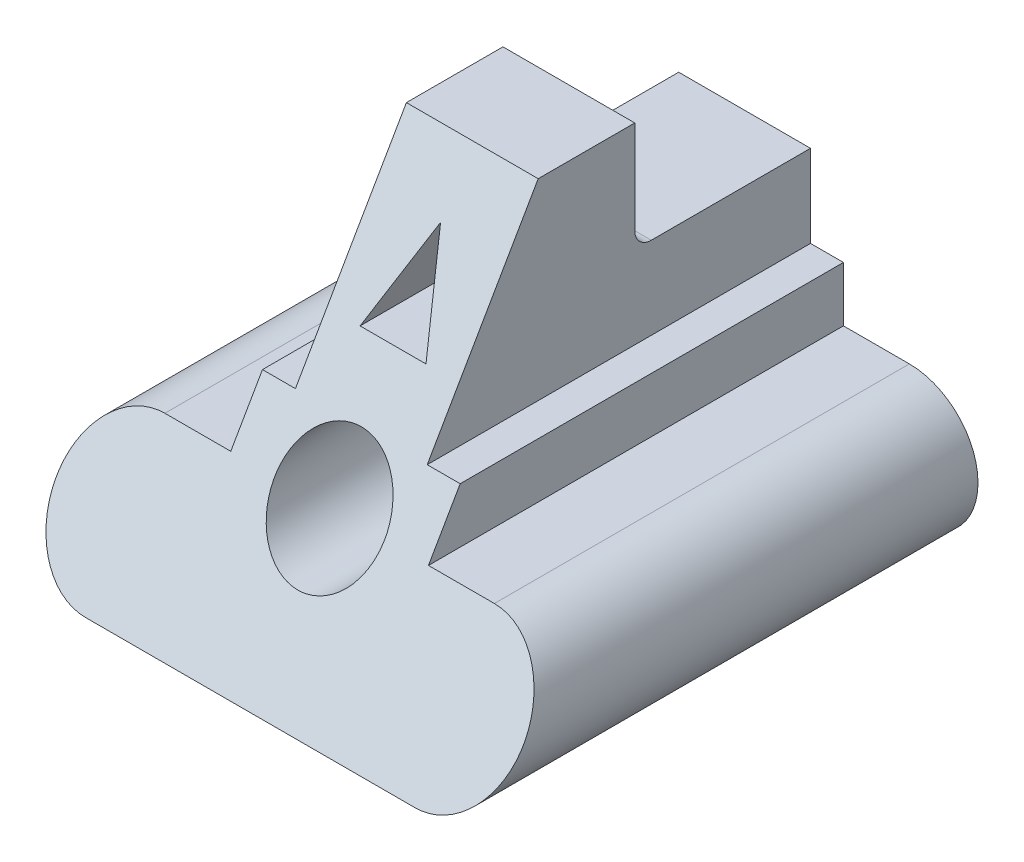
ISO-10303-21;
HEADER;
FILE_DESCRIPTION(('STEP AP214'),'2;1');
FILE_NAME('part.step','',(''),(''),'','','');
FILE_SCHEMA(('AUTOMOTIVE_DESIGN { 1 0 10303 214 1 1 1 1 }'));
ENDSEC;
DATA;
#1=APPLICATION_CONTEXT('core data for automotive mechanical design processes');
#2=APPLICATION_PROTOCOL_DEFINITION('international standard','automotive_design',2000,#1);
#3=PRODUCT_CONTEXT('',#1,'mechanical');
#4=PRODUCT('Part','Part','',(#3));
#5=PRODUCT_RELATED_PRODUCT_CATEGORY('part','',(#4));
#6=PRODUCT_DEFINITION_FORMATION('','',#4);
#7=PRODUCT_DEFINITION_CONTEXT('part definition',#1,'design');
#8=PRODUCT_DEFINITION('design','',#6,#7);
#9=PRODUCT_DEFINITION_SHAPE('','',#8);
#10=(LENGTH_UNIT() NAMED_UNIT(*) SI_UNIT(.MILLI.,.METRE.));
#11=(NAMED_UNIT(*) PLANE_ANGLE_UNIT() SI_UNIT($,.RADIAN.));
#12=(NAMED_UNIT(*) SI_UNIT($,.STERADIAN.) SOLID_ANGLE_UNIT());
#13=UNCERTAINTY_MEASURE_WITH_UNIT(LENGTH_MEASURE(1.E-05),#10,'distance_accuracy_value','');
#14=(GEOMETRIC_REPRESENTATION_CONTEXT(3) GLOBAL_UNCERTAINTY_ASSIGNED_CONTEXT((#13)) GLOBAL_UNIT_ASSIGNED_CONTEXT((#10,
#11,#12)) REPRESENTATION_CONTEXT('',''));
#15=CARTESIAN_POINT('',(0.,0.,0.));
#16=DIRECTION('',(0.,0.,1.));
#17=DIRECTION('',(1.,0.,0.));
#18=AXIS2_PLACEMENT_3D('',#15,#16,#17);
#19=CARTESIAN_POINT('',(-30.,0.,-90.));
#20=DIRECTION('',(0.,0.,1.));
#21=DIRECTION('',(1.,0.,0.));
#22=AXIS2_PLACEMENT_3D('',#19,#20,#21);
#23=CYLINDRICAL_SURFACE('',#22,12.5);
#24=CARTESIAN_POINT('',(-30.,0.,-7.21687836487028));
#25=DIRECTION('',(0.,-0.499999999999998,-0.86602540378444));
#26=DIRECTION('',(0.,-0.86602540378444,0.499999999999998));
#27=AXIS2_PLACEMENT_3D('',#24,#25,#26);
#28=ELLIPSE('',#27,14.4337567297406,12.5);
#29=CARTESIAN_POINT('',(-30.,12.5,-14.4337567297406));
#30=VERTEX_POINT('',#29);
#31=CARTESIAN_POINT('',(-30.,-12.5,0.));
#32=VERTEX_POINT('',#31);
#33=EDGE_CURVE('E365',#30,#32,#28,.F.);
#34=ORIENTED_EDGE('',*,*,#33,.F.);
#35=DIRECTION('',(0.,0.,1.));
#36=VECTOR('',#35,1.);
#37=CARTESIAN_POINT('',(-30.,12.5,-90.));
#38=LINE('',#37,#36);
#39=CARTESIAN_POINT('',(-30.,12.5,-90.));
#40=VERTEX_POINT('',#39);
#41=EDGE_CURVE('E261',#40,#30,#38,.T.);
#42=ORIENTED_EDGE('',*,*,#41,.F.);
#43=CARTESIAN_POINT('',(-30.,0.,-90.));
#44=DIRECTION('',(0.,0.,1.));
#45=DIRECTION('',(1.,0.,0.));
#46=AXIS2_PLACEMENT_3D('',#43,#44,#45);
#47=CIRCLE('',#46,12.5);
#48=CARTESIAN_POINT('',(-30.,-12.5,-90.));
#49=VERTEX_POINT('',#48);
#50=EDGE_CURVE('E215',#40,#49,#47,.T.);
#51=ORIENTED_EDGE('',*,*,#50,.T.);
#52=DIRECTION('',(0.,0.,1.));
#53=VECTOR('',#52,1.);
#54=CARTESIAN_POINT('',(-30.,-12.5,-90.));
#55=LINE('',#54,#53);
#56=EDGE_CURVE('E258',#49,#32,#55,.T.);
#57=ORIENTED_EDGE('',*,*,#56,.T.);
#58=EDGE_LOOP('',(#34,#42,#51,#57));
#59=FACE_BOUND('',#58,.T.);
#60=ADVANCED_FACE('F39',(#59),#23,.T.);
#61=CARTESIAN_POINT('',(-30.,12.5,-90.));
#62=DIRECTION('',(0.,1.,0.));
#63=DIRECTION('',(0.,0.,1.));
#64=AXIS2_PLACEMENT_3D('',#61,#62,#63);
#65=PLANE('',#64);
#66=DIRECTION('',(-1.,0.,0.));
#67=VECTOR('',#66,1.);
#68=CARTESIAN_POINT('',(-30.,12.5,-14.4337567297406));
#69=LINE('',#68,#67);
#70=CARTESIAN_POINT('',(-18.,12.5,-14.4337567297406));
#71=VERTEX_POINT('',#70);
#72=EDGE_CURVE('E362',#71,#30,#69,.T.);
#73=ORIENTED_EDGE('',*,*,#72,.F.);
#74=DIRECTION('',(0.,0.,1.));
#75=VECTOR('',#74,1.);
#76=CARTESIAN_POINT('',(-18.,12.5,-90.));
#77=LINE('',#76,#75);
#78=CARTESIAN_POINT('',(-18.,12.5,-90.));
#79=VERTEX_POINT('',#78);
#80=EDGE_CURVE('E266',#79,#71,#77,.T.);
#81=ORIENTED_EDGE('',*,*,#80,.F.);
#82=DIRECTION('',(-1.,0.,0.));
#83=VECTOR('',#82,1.);
#84=CARTESIAN_POINT('',(-30.,12.5,-90.));
#85=LINE('',#84,#83);
#86=EDGE_CURVE('E254',#79,#40,#85,.T.);
#87=ORIENTED_EDGE('',*,*,#86,.T.);
#88=ORIENTED_EDGE('',*,*,#41,.T.);
#89=EDGE_LOOP('',(#73,#81,#87,#88));
#90=FACE_BOUND('',#89,.T.);
#91=ADVANCED_FACE('F422',(#90),#65,.T.);
#92=CARTESIAN_POINT('',(-18.,12.5,-90.));
#93=DIRECTION('',(-1.,0.,0.));
#94=DIRECTION('',(0.,0.,1.));
#95=AXIS2_PLACEMENT_3D('',#92,#93,#94);
#96=PLANE('',#95);
#97=DIRECTION('',(0.,-0.86602540378444,0.499999999999998));
#98=VECTOR('',#97,1.);
#99=CARTESIAN_POINT('',(-18.,45.2211431702997,-33.3253175473053));
#100=LINE('',#99,#98);
#101=CARTESIAN_POINT('',(-18.,22.5,-20.2072594216368));
#102=VERTEX_POINT('',#101);
#103=EDGE_CURVE('E359',#102,#71,#100,.T.);
#104=ORIENTED_EDGE('',*,*,#103,.F.);
#105=DIRECTION('',(0.,0.,1.));
#106=VECTOR('',#105,1.);
#107=CARTESIAN_POINT('',(-18.,22.5,-90.));
#108=LINE('',#107,#106);
#109=CARTESIAN_POINT('',(-18.,22.5,-90.));
#110=VERTEX_POINT('',#109);
#111=EDGE_CURVE('E270',#110,#102,#108,.T.);
#112=ORIENTED_EDGE('',*,*,#111,.F.);
#113=DIRECTION('',(0.,-1.,0.));
#114=VECTOR('',#113,1.);
#115=CARTESIAN_POINT('',(-18.,12.5,-90.));
#116=LINE('',#115,#114);
#117=EDGE_CURVE('E250',#110,#79,#116,.T.);
#118=ORIENTED_EDGE('',*,*,#117,.T.);
#119=ORIENTED_EDGE('',*,*,#80,.T.);
#120=EDGE_LOOP('',(#104,#112,#118,#119));
#121=FACE_BOUND('',#120,.T.);
#122=ADVANCED_FACE('F431',(#121),#96,.T.);
#123=CARTESIAN_POINT('',(-18.,22.5,-90.));
#124=DIRECTION('',(0.,1.,0.));
#125=DIRECTION('',(0.,0.,1.));
#126=AXIS2_PLACEMENT_3D('',#123,#124,#125);
#127=PLANE('',#126);
#128=DIRECTION('',(-1.,0.,0.));
#129=VECTOR('',#128,1.);
#130=CARTESIAN_POINT('',(-18.,22.5,-20.2072594216368));
#131=LINE('',#130,#129);
#132=CARTESIAN_POINT('',(-12.,22.5,-20.2072594216368));
#133=VERTEX_POINT('',#132);
#134=EDGE_CURVE('E351',#133,#102,#131,.T.);
#135=ORIENTED_EDGE('',*,*,#134,.F.);
#136=DIRECTION('',(0.,0.,1.));
#137=VECTOR('',#136,1.);
#138=CARTESIAN_POINT('',(-12.,22.5,-90.));
#139=LINE('',#138,#137);
#140=CARTESIAN_POINT('',(-12.,22.5,-90.));
#141=VERTEX_POINT('',#140);
#142=EDGE_CURVE('E274',#141,#133,#139,.T.);
#143=ORIENTED_EDGE('',*,*,#142,.F.);
#144=DIRECTION('',(-1.,0.,0.));
#145=VECTOR('',#144,1.);
#146=CARTESIAN_POINT('',(-18.,22.5,-90.));
#147=LINE('',#146,#145);
#148=EDGE_CURVE('E246',#141,#110,#147,.T.);
#149=ORIENTED_EDGE('',*,*,#148,.T.);
#150=ORIENTED_EDGE('',*,*,#111,.T.);
#151=EDGE_LOOP('',(#135,#143,#149,#150));
#152=FACE_BOUND('',#151,.T.);
#153=ADVANCED_FACE('F429',(#152),#127,.T.);
#154=CARTESIAN_POINT('',(-12.,22.5,-90.));
#155=DIRECTION('',(-1.,0.,0.));
#156=DIRECTION('',(0.,0.,1.));
#157=AXIS2_PLACEMENT_3D('',#154,#155,#156);
#158=PLANE('',#157);
#159=DIRECTION('',(0.,-0.86602540378444,0.499999999999998));
#160=VECTOR('',#159,1.);
#161=CARTESIAN_POINT('',(-12.,52.7211431702997,-37.6554445662275));
#162=LINE('',#161,#160);
#163=CARTESIAN_POINT('',(-12.,57.5,-40.4145188432736));
#164=VERTEX_POINT('',#163);
#165=EDGE_CURVE('E346',#164,#133,#162,.T.);
#166=ORIENTED_EDGE('',*,*,#165,.F.);
#167=DIRECTION('',(0.,0.,1.));
#168=VECTOR('',#167,1.);
#169=CARTESIAN_POINT('',(-12.,57.5,-90.));
#170=LINE('',#169,#168);
#171=CARTESIAN_POINT('',(-12.,57.5,-58.));
#172=VERTEX_POINT('',#171);
#173=EDGE_CURVE('E278',#172,#164,#170,.T.);
#174=ORIENTED_EDGE('',*,*,#173,.F.);
#175=DIRECTION('',(0.,1.,0.));
#176=VECTOR('',#175,1.);
#177=CARTESIAN_POINT('',(-12.,22.5,-58.));
#178=LINE('',#177,#176);
#179=CARTESIAN_POINT('',(-12.,40.5,-58.));
#180=VERTEX_POINT('',#179);
#181=EDGE_CURVE('E207',#180,#172,#178,.T.);
#182=ORIENTED_EDGE('',*,*,#181,.F.);
#183=CARTESIAN_POINT('',(-12.,40.5,-61.));
#184=DIRECTION('',(-1.,0.,0.));
#185=DIRECTION('',(0.,0.,1.));
#186=AXIS2_PLACEMENT_3D('',#183,#184,#185);
#187=CIRCLE('',#186,3.);
#188=CARTESIAN_POINT('',(-12.,37.5,-61.));
#189=VERTEX_POINT('',#188);
#190=EDGE_CURVE('E48',#180,#189,#187,.F.);
#191=ORIENTED_EDGE('',*,*,#190,.T.);
#192=DIRECTION('',(0.,0.,1.));
#193=VECTOR('',#192,1.);
#194=CARTESIAN_POINT('',(-12.,37.5,-90.));
#195=LINE('',#194,#193);
#196=CARTESIAN_POINT('',(-12.,37.5,-90.));
#197=VERTEX_POINT('',#196);
#198=EDGE_CURVE('E203',#197,#189,#195,.T.);
#199=ORIENTED_EDGE('',*,*,#198,.F.);
#200=DIRECTION('',(0.,-1.,0.));
#201=VECTOR('',#200,1.);
#202=CARTESIAN_POINT('',(-12.,22.5,-90.));
#203=LINE('',#202,#201);
#204=EDGE_CURVE('E243',#197,#141,#203,.T.);
#205=ORIENTED_EDGE('',*,*,#204,.T.);
#206=ORIENTED_EDGE('',*,*,#142,.T.);
#207=EDGE_LOOP('',(#166,#174,#182,#191,#199,#205,#206));
#208=FACE_BOUND('',#207,.T.);
#209=ADVANCED_FACE('F326',(#208),#158,.T.);
#210=CARTESIAN_POINT('',(-12.,57.5,-90.));
#211=DIRECTION('',(0.,1.,0.));
#212=DIRECTION('',(0.,0.,1.));
#213=AXIS2_PLACEMENT_3D('',#210,#211,#212);
#214=PLANE('',#213);
#215=DIRECTION('',(-1.,0.,0.));
#216=VECTOR('',#215,1.);
#217=CARTESIAN_POINT('',(-12.,57.5,-40.4145188432736));
#218=LINE('',#217,#216);
#219=CARTESIAN_POINT('',(12.,57.5,-40.4145188432736));
#220=VERTEX_POINT('',#219);
#221=EDGE_CURVE('E343',#220,#164,#218,.T.);
#222=ORIENTED_EDGE('',*,*,#221,.F.);
#223=DIRECTION('',(0.,0.,1.));
#224=VECTOR('',#223,1.);
#225=CARTESIAN_POINT('',(12.,57.5,-90.));
#226=LINE('',#225,#224);
#227=CARTESIAN_POINT('',(12.,57.5,-58.));
#228=VERTEX_POINT('',#227);
#229=EDGE_CURVE('E282',#228,#220,#226,.T.);
#230=ORIENTED_EDGE('',*,*,#229,.F.);
#231=DIRECTION('',(1.,0.,0.));
#232=VECTOR('',#231,1.);
#233=CARTESIAN_POINT('',(-18.,57.5,-58.));
#234=LINE('',#233,#232);
#235=EDGE_CURVE('E200',#172,#228,#234,.T.);
#236=ORIENTED_EDGE('',*,*,#235,.F.);
#237=ORIENTED_EDGE('',*,*,#173,.T.);
#238=EDGE_LOOP('',(#222,#230,#236,#237));
#239=FACE_BOUND('',#238,.T.);
#240=ADVANCED_FACE('F342',(#239),#214,.T.);
#241=CARTESIAN_POINT('',(12.,57.5,-90.));
#242=DIRECTION('',(1.,0.,0.));
#243=DIRECTION('',(0.,1.,0.));
#244=AXIS2_PLACEMENT_3D('',#241,#242,#243);
#245=PLANE('',#244);
#246=DIRECTION('',(0.,0.86602540378444,-0.499999999999998));
#247=VECTOR('',#246,1.);
#248=CARTESIAN_POINT('',(12.,78.9711431702998,-52.8108891324551));
#249=LINE('',#248,#247);
#250=CARTESIAN_POINT('',(12.,22.5,-20.2072594216368));
#251=VERTEX_POINT('',#250);
#252=EDGE_CURVE('E347',#251,#220,#249,.T.);
#253=ORIENTED_EDGE('',*,*,#252,.F.);
#254=DIRECTION('',(0.,0.,1.));
#255=VECTOR('',#254,1.);
#256=CARTESIAN_POINT('',(12.,22.5,-90.));
#257=LINE('',#256,#255);
#258=CARTESIAN_POINT('',(12.,22.5,-90.));
#259=VERTEX_POINT('',#258);
#260=EDGE_CURVE('E286',#259,#251,#257,.T.);
#261=ORIENTED_EDGE('',*,*,#260,.F.);
#262=DIRECTION('',(0.,1.,0.));
#263=VECTOR('',#262,1.);
#264=CARTESIAN_POINT('',(12.,57.5,-90.));
#265=LINE('',#264,#263);
#266=CARTESIAN_POINT('',(12.,37.5,-90.));
#267=VERTEX_POINT('',#266);
#268=EDGE_CURVE('E239',#259,#267,#265,.T.);
#269=ORIENTED_EDGE('',*,*,#268,.T.);
#270=DIRECTION('',(0.,0.,-1.));
#271=VECTOR('',#270,1.);
#272=CARTESIAN_POINT('',(12.,37.5,-58.));
#273=LINE('',#272,#271);
#274=CARTESIAN_POINT('',(12.,37.5,-61.));
#275=VERTEX_POINT('',#274);
#276=EDGE_CURVE('E197',#275,#267,#273,.T.);
#277=ORIENTED_EDGE('',*,*,#276,.F.);
#278=CARTESIAN_POINT('',(12.,40.5,-61.));
#279=DIRECTION('',(1.,0.,0.));
#280=DIRECTION('',(0.,1.,0.));
#281=AXIS2_PLACEMENT_3D('',#278,#279,#280);
#282=CIRCLE('',#281,3.);
#283=CARTESIAN_POINT('',(12.,40.5,-58.));
#284=VERTEX_POINT('',#283);
#285=EDGE_CURVE('E62',#275,#284,#282,.F.);
#286=ORIENTED_EDGE('',*,*,#285,.T.);
#287=DIRECTION('',(0.,-1.,0.));
#288=VECTOR('',#287,1.);
#289=CARTESIAN_POINT('',(12.,57.5,-58.));
#290=LINE('',#289,#288);
#291=EDGE_CURVE('E194',#228,#284,#290,.T.);
#292=ORIENTED_EDGE('',*,*,#291,.F.);
#293=ORIENTED_EDGE('',*,*,#229,.T.);
#294=EDGE_LOOP('',(#253,#261,#269,#277,#286,#292,#293));
#295=FACE_BOUND('',#294,.T.);
#296=ADVANCED_FACE('F339',(#295),#245,.T.);
#297=CARTESIAN_POINT('',(12.,22.5,-90.));
#298=DIRECTION('',(0.,1.,0.));
#299=DIRECTION('',(0.,0.,1.));
#300=AXIS2_PLACEMENT_3D('',#297,#298,#299);
#301=PLANE('',#300);
#302=DIRECTION('',(-1.,0.,0.));
#303=VECTOR('',#302,1.);
#304=CARTESIAN_POINT('',(12.,22.5,-20.2072594216368));
#305=LINE('',#304,#303);
#306=CARTESIAN_POINT('',(18.,22.5,-20.2072594216368));
#307=VERTEX_POINT('',#306);
#308=EDGE_CURVE('E353',#307,#251,#305,.T.);
#309=ORIENTED_EDGE('',*,*,#308,.F.);
#310=DIRECTION('',(0.,0.,1.));
#311=VECTOR('',#310,1.);
#312=CARTESIAN_POINT('',(18.,22.5,-90.));
#313=LINE('',#312,#311);
#314=CARTESIAN_POINT('',(18.,22.5,-90.));
#315=VERTEX_POINT('',#314);
#316=EDGE_CURVE('E290',#315,#307,#313,.T.);
#317=ORIENTED_EDGE('',*,*,#316,.F.);
#318=DIRECTION('',(-1.,0.,0.));
#319=VECTOR('',#318,1.);
#320=CARTESIAN_POINT('',(12.,22.5,-90.));
#321=LINE('',#320,#319);
#322=EDGE_CURVE('E235',#315,#259,#321,.T.);
#323=ORIENTED_EDGE('',*,*,#322,.T.);
#324=ORIENTED_EDGE('',*,*,#260,.T.);
#325=EDGE_LOOP('',(#309,#317,#323,#324));
#326=FACE_BOUND('',#325,.T.);
#327=ADVANCED_FACE('F397',(#326),#301,.T.);
#328=CARTESIAN_POINT('',(18.,22.5,-90.));
#329=DIRECTION('',(1.,0.,0.));
#330=DIRECTION('',(0.,0.,-1.));
#331=AXIS2_PLACEMENT_3D('',#328,#329,#330);
#332=PLANE('',#331);
#333=DIRECTION('',(0.,0.86602540378444,-0.499999999999998));
#334=VECTOR('',#333,1.);
#335=CARTESIAN_POINT('',(18.,52.7211431702997,-37.6554445662275));
#336=LINE('',#335,#334);
#337=CARTESIAN_POINT('',(18.,12.5,-14.4337567297406));
#338=VERTEX_POINT('',#337);
#339=EDGE_CURVE('E390',#338,#307,#336,.T.);
#340=ORIENTED_EDGE('',*,*,#339,.F.);
#341=DIRECTION('',(0.,0.,1.));
#342=VECTOR('',#341,1.);
#343=CARTESIAN_POINT('',(18.,12.5,-90.));
#344=LINE('',#343,#342);
#345=CARTESIAN_POINT('',(18.,12.5,-90.));
#346=VERTEX_POINT('',#345);
#347=EDGE_CURVE('E294',#346,#338,#344,.T.);
#348=ORIENTED_EDGE('',*,*,#347,.F.);
#349=DIRECTION('',(0.,1.,0.));
#350=VECTOR('',#349,1.);
#351=CARTESIAN_POINT('',(18.,22.5,-90.));
#352=LINE('',#351,#350);
#353=EDGE_CURVE('E231',#346,#315,#352,.T.);
#354=ORIENTED_EDGE('',*,*,#353,.T.);
#355=ORIENTED_EDGE('',*,*,#316,.T.);
#356=EDGE_LOOP('',(#340,#348,#354,#355));
#357=FACE_BOUND('',#356,.T.);
#358=ADVANCED_FACE('F404',(#357),#332,.T.);
#359=CARTESIAN_POINT('',(18.,12.5,-90.));
#360=DIRECTION('',(0.,1.,0.));
#361=DIRECTION('',(0.,0.,1.));
#362=AXIS2_PLACEMENT_3D('',#359,#360,#361);
#363=PLANE('',#362);
#364=DIRECTION('',(-1.,0.,0.));
#365=VECTOR('',#364,1.);
#366=CARTESIAN_POINT('',(18.,12.5,-14.4337567297406));
#367=LINE('',#366,#365);
#368=CARTESIAN_POINT('',(30.,12.5,-14.4337567297406));
#369=VERTEX_POINT('',#368);
#370=EDGE_CURVE('E387',#369,#338,#367,.T.);
#371=ORIENTED_EDGE('',*,*,#370,.F.);
#372=DIRECTION('',(0.,0.,1.));
#373=VECTOR('',#372,1.);
#374=CARTESIAN_POINT('',(30.,12.5,-90.));
#375=LINE('',#374,#373);
#376=CARTESIAN_POINT('',(30.,12.5,-90.));
#377=VERTEX_POINT('',#376);
#378=EDGE_CURVE('E298',#377,#369,#375,.T.);
#379=ORIENTED_EDGE('',*,*,#378,.F.);
#380=DIRECTION('',(-1.,0.,0.));
#381=VECTOR('',#380,1.);
#382=CARTESIAN_POINT('',(18.,12.5,-90.));
#383=LINE('',#382,#381);
#384=EDGE_CURVE('E227',#377,#346,#383,.T.);
#385=ORIENTED_EDGE('',*,*,#384,.T.);
#386=ORIENTED_EDGE('',*,*,#347,.T.);
#387=EDGE_LOOP('',(#371,#379,#385,#386));
#388=FACE_BOUND('',#387,.T.);
#389=ADVANCED_FACE('F407',(#388),#363,.T.);
#390=CARTESIAN_POINT('',(30.,0.,-90.));
#391=DIRECTION('',(0.,0.,1.));
#392=DIRECTION('',(1.,0.,0.));
#393=AXIS2_PLACEMENT_3D('',#390,#391,#392);
#394=CYLINDRICAL_SURFACE('',#393,12.5);
#395=CARTESIAN_POINT('',(30.,0.,-7.21687836487028));
#396=DIRECTION('',(0.,-0.499999999999998,-0.86602540378444));
#397=DIRECTION('',(0.,-0.86602540378444,0.499999999999998));
#398=AXIS2_PLACEMENT_3D('',#395,#396,#397);
#399=ELLIPSE('',#398,14.4337567297406,12.5);
#400=CARTESIAN_POINT('',(30.,-12.5,0.));
#401=VERTEX_POINT('',#400);
#402=EDGE_CURVE('E384',#401,#369,#399,.F.);
#403=ORIENTED_EDGE('',*,*,#402,.F.);
#404=DIRECTION('',(0.,0.,1.));
#405=VECTOR('',#404,1.);
#406=CARTESIAN_POINT('',(30.,-12.5,-90.));
#407=LINE('',#406,#405);
#408=CARTESIAN_POINT('',(30.,-12.5,-90.));
#409=VERTEX_POINT('',#408);
#410=EDGE_CURVE('E302',#409,#401,#407,.T.);
#411=ORIENTED_EDGE('',*,*,#410,.F.);
#412=CARTESIAN_POINT('',(30.,0.,-90.));
#413=DIRECTION('',(0.,0.,1.));
#414=DIRECTION('',(1.,0.,0.));
#415=AXIS2_PLACEMENT_3D('',#412,#413,#414);
#416=CIRCLE('',#415,12.5);
#417=EDGE_CURVE('E223',#409,#377,#416,.T.);
#418=ORIENTED_EDGE('',*,*,#417,.T.);
#419=ORIENTED_EDGE('',*,*,#378,.T.);
#420=EDGE_LOOP('',(#403,#411,#418,#419));
#421=FACE_BOUND('',#420,.T.);
#422=ADVANCED_FACE('F412',(#421),#394,.T.);
#423=CARTESIAN_POINT('',(-30.,-12.5,-90.));
#424=DIRECTION('',(0.,-1.,0.));
#425=DIRECTION('',(0.,0.,-1.));
#426=AXIS2_PLACEMENT_3D('',#423,#424,#425);
#427=PLANE('',#426);
#428=DIRECTION('',(1.,0.,0.));
#429=VECTOR('',#428,1.);
#430=CARTESIAN_POINT('',(-30.,-12.5,0.));
#431=LINE('',#430,#429);
#432=EDGE_CURVE('E214',#32,#401,#431,.T.);
#433=ORIENTED_EDGE('',*,*,#432,.F.);
#434=ORIENTED_EDGE('',*,*,#56,.F.);
#435=DIRECTION('',(1.,0.,0.));
#436=VECTOR('',#435,1.);
#437=CARTESIAN_POINT('',(-30.,-12.5,-90.));
#438=LINE('',#437,#436);
#439=EDGE_CURVE('E219',#49,#409,#438,.T.);
#440=ORIENTED_EDGE('',*,*,#439,.T.);
#441=ORIENTED_EDGE('',*,*,#410,.T.);
#442=EDGE_LOOP('',(#433,#434,#440,#441));
#443=FACE_BOUND('',#442,.T.);
#444=ADVANCED_FACE('F415',(#443),#427,.T.);
#445=CARTESIAN_POINT('',(-30.,0.,-90.));
#446=DIRECTION('',(0.,0.,1.));
#447=DIRECTION('',(1.,0.,0.));
#448=AXIS2_PLACEMENT_3D('',#445,#446,#447);
#449=PLANE('',#448);
#450=CARTESIAN_POINT('',(0.,12.5,-90.));
#451=DIRECTION('',(0.,0.,1.));
#452=DIRECTION('',(1.,0.,0.));
#453=AXIS2_PLACEMENT_3D('',#450,#451,#452);
#454=CIRCLE('',#453,10.);
#455=CARTESIAN_POINT('',(10.,12.5,-90.));
#456=VERTEX_POINT('',#455);
#457=EDGE_CURVE('E210',#456,#456,#454,.T.);
#458=ORIENTED_EDGE('',*,*,#457,.T.);
#459=EDGE_LOOP('',(#458));
#460=FACE_BOUND('',#459,.T.);
#461=ORIENTED_EDGE('',*,*,#204,.F.);
#462=DIRECTION('',(1.,0.,0.));
#463=VECTOR('',#462,1.);
#464=CARTESIAN_POINT('',(-30.,37.5,-90.));
#465=LINE('',#464,#463);
#466=EDGE_CURVE('E265',#197,#267,#465,.T.);
#467=ORIENTED_EDGE('',*,*,#466,.T.);
#468=ORIENTED_EDGE('',*,*,#268,.F.);
#469=ORIENTED_EDGE('',*,*,#322,.F.);
#470=ORIENTED_EDGE('',*,*,#353,.F.);
#471=ORIENTED_EDGE('',*,*,#384,.F.);
#472=ORIENTED_EDGE('',*,*,#417,.F.);
#473=ORIENTED_EDGE('',*,*,#439,.F.);
#474=ORIENTED_EDGE('',*,*,#50,.F.);
#475=ORIENTED_EDGE('',*,*,#86,.F.);
#476=ORIENTED_EDGE('',*,*,#117,.F.);
#477=ORIENTED_EDGE('',*,*,#148,.F.);
#478=EDGE_LOOP('',(#461,#467,#468,#469,#470,#471,#472,#473,#474,#475,#476,#477));
#479=FACE_BOUND('',#478,.T.);
#480=ADVANCED_FACE('F401',(#460,#479),#449,.F.);
#481=CARTESIAN_POINT('',(0.,12.5,-90.));
#482=DIRECTION('',(0.,0.,1.));
#483=DIRECTION('',(1.,0.,0.));
#484=AXIS2_PLACEMENT_3D('',#481,#482,#483);
#485=CYLINDRICAL_SURFACE('',#484,10.);
#486=CARTESIAN_POINT('',(0.,12.5,-14.4337567297406));
#487=DIRECTION('',(0.,-0.499999999999998,-0.86602540378444));
#488=DIRECTION('',(0.,-0.86602540378444,0.499999999999998));
#489=AXIS2_PLACEMENT_3D('',#486,#487,#488);
#490=ELLIPSE('',#489,11.5470053837925,10.);
#491=CARTESIAN_POINT('',(0.,2.5,-8.66025403784434));
#492=VERTEX_POINT('',#491);
#493=EDGE_CURVE('E177',#492,#492,#490,.F.);
#494=ORIENTED_EDGE('',*,*,#493,.T.);
#495=EDGE_LOOP('',(#494));
#496=FACE_BOUND('',#495,.T.);
#497=ORIENTED_EDGE('',*,*,#457,.F.);
#498=EDGE_LOOP('',(#497));
#499=FACE_BOUND('',#498,.T.);
#500=ADVANCED_FACE('F498',(#496,#499),#485,.F.);
#501=CARTESIAN_POINT('',(-18.,57.5,-58.));
#502=DIRECTION('',(0.,0.,1.));
#503=DIRECTION('',(1.,0.,0.));
#504=AXIS2_PLACEMENT_3D('',#501,#502,#503);
#505=PLANE('',#504);
#506=ORIENTED_EDGE('',*,*,#291,.T.);
#507=DIRECTION('',(1.,0.,0.));
#508=VECTOR('',#507,1.);
#509=CARTESIAN_POINT('',(-12.,40.5,-58.));
#510=LINE('',#509,#508);
#511=EDGE_CURVE('E316',#284,#180,#510,.F.);
#512=ORIENTED_EDGE('',*,*,#511,.T.);
#513=ORIENTED_EDGE('',*,*,#181,.T.);
#514=ORIENTED_EDGE('',*,*,#235,.T.);
#515=EDGE_LOOP('',(#506,#512,#513,#514));
#516=FACE_BOUND('',#515,.T.);
#517=ADVANCED_FACE('F335',(#516),#505,.F.);
#518=CARTESIAN_POINT('',(-18.,37.5,-58.));
#519=DIRECTION('',(0.,-1.,0.));
#520=DIRECTION('',(0.,0.,-1.));
#521=AXIS2_PLACEMENT_3D('',#518,#519,#520);
#522=PLANE('',#521);
#523=ORIENTED_EDGE('',*,*,#198,.T.);
#524=DIRECTION('',(1.,0.,0.));
#525=VECTOR('',#524,1.);
#526=CARTESIAN_POINT('',(12.,37.5,-61.));
#527=LINE('',#526,#525);
#528=EDGE_CURVE('E312',#189,#275,#527,.T.);
#529=ORIENTED_EDGE('',*,*,#528,.T.);
#530=ORIENTED_EDGE('',*,*,#276,.T.);
#531=ORIENTED_EDGE('',*,*,#466,.F.);
#532=EDGE_LOOP('',(#523,#529,#530,#531));
#533=FACE_BOUND('',#532,.T.);
#534=ADVANCED_FACE('F333',(#533),#522,.F.);
#535=CARTESIAN_POINT('',(-18.,40.5,-61.));
#536=DIRECTION('',(-1.,0.,0.));
#537=DIRECTION('',(0.,-1.,0.));
#538=AXIS2_PLACEMENT_3D('',#535,#536,#537);
#539=CYLINDRICAL_SURFACE('',#538,3.);
#540=ORIENTED_EDGE('',*,*,#190,.F.);
#541=ORIENTED_EDGE('',*,*,#511,.F.);
#542=ORIENTED_EDGE('',*,*,#285,.F.);
#543=ORIENTED_EDGE('',*,*,#528,.F.);
#544=EDGE_LOOP('',(#540,#541,#542,#543));
#545=FACE_BOUND('',#544,.T.);
#546=ADVANCED_FACE('F41',(#545),#539,.F.);
#547=CARTESIAN_POINT('',(0.,-3.12499999999997,-5.41265877365272));
#548=DIRECTION('',(0.,-0.499999999999998,-0.86602540378444));
#549=DIRECTION('',(0.,0.86602540378444,-0.499999999999998));
#550=AXIS2_PLACEMENT_3D('',#547,#548,#549);
#551=PLANE('',#550);
#552=ORIENTED_EDGE('',*,*,#33,.T.);
#553=ORIENTED_EDGE('',*,*,#432,.T.);
#554=ORIENTED_EDGE('',*,*,#402,.T.);
#555=ORIENTED_EDGE('',*,*,#370,.T.);
#556=ORIENTED_EDGE('',*,*,#339,.T.);
#557=ORIENTED_EDGE('',*,*,#308,.T.);
#558=ORIENTED_EDGE('',*,*,#252,.T.);
#559=ORIENTED_EDGE('',*,*,#221,.T.);
#560=ORIENTED_EDGE('',*,*,#165,.T.);
#561=ORIENTED_EDGE('',*,*,#134,.T.);
#562=ORIENTED_EDGE('',*,*,#103,.T.);
#563=ORIENTED_EDGE('',*,*,#72,.T.);
#564=EDGE_LOOP('',(#552,#553,#554,#555,#556,#557,#558,#559,#560,#561,#562,#563));
#565=FACE_BOUND('',#564,.T.);
#566=DIRECTION('',(1.,0.,0.));
#567=VECTOR('',#566,1.);
#568=CARTESIAN_POINT('',(-6.,32.5,-25.980762113533));
#569=LINE('',#568,#567);
#570=CARTESIAN_POINT('',(-6.,32.5,-25.980762113533));
#571=VERTEX_POINT('',#570);
#572=CARTESIAN_POINT('',(6.,32.5,-25.980762113533));
#573=VERTEX_POINT('',#572);
#574=EDGE_CURVE('E55',#571,#573,#569,.T.);
#575=ORIENTED_EDGE('',*,*,#574,.F.);
#576=DIRECTION('',(-0.327326835353989,-0.818317088384973,0.472455591261532));
#577=VECTOR('',#576,1.);
#578=CARTESIAN_POINT('',(3.14846378716861,55.3711594679215,-39.1854321890163));
#579=LINE('',#578,#577);
#580=CARTESIAN_POINT('',(0.,47.5,-34.6410161513774));
#581=VERTEX_POINT('',#580);
#582=EDGE_CURVE('E11',#581,#571,#579,.T.);
#583=ORIENTED_EDGE('',*,*,#582,.F.);
#584=DIRECTION('',(-0.327326835353989,0.818317088384973,-0.472455591261532));
#585=VECTOR('',#584,1.);
#586=CARTESIAN_POINT('',(1.51225049854568,43.7193737536358,-32.4582705703336));
#587=LINE('',#586,#585);
#588=EDGE_CURVE('E165',#573,#581,#587,.T.);
#589=ORIENTED_EDGE('',*,*,#588,.F.);
#590=EDGE_LOOP('',(#575,#583,#589));
#591=FACE_BOUND('',#590,.T.);
#592=ORIENTED_EDGE('',*,*,#493,.F.);
#593=EDGE_LOOP('',(#592));
#594=FACE_BOUND('',#593,.T.);
#595=ADVANCED_FACE('F163',(#565,#591,#594),#551,.F.);
#596=CARTESIAN_POINT('',(0.,0.,-55.));
#597=DIRECTION('',(0.,0.,-1.));
#598=DIRECTION('',(-1.,0.,0.));
#599=AXIS2_PLACEMENT_3D('',#596,#597,#598);
#600=PLANE('',#599);
#601=DIRECTION('',(-0.371390676354104,0.928476690885259,0.));
#602=VECTOR('',#601,1.);
#603=CARTESIAN_POINT('',(6.,32.5,-55.));
#604=LINE('',#603,#602);
#605=CARTESIAN_POINT('',(6.,32.5,-55.));
#606=VERTEX_POINT('',#605);
#607=CARTESIAN_POINT('',(0.,47.5,-55.));
#608=VERTEX_POINT('',#607);
#609=EDGE_CURVE('E368',#606,#608,#604,.T.);
#610=ORIENTED_EDGE('',*,*,#609,.T.);
#611=DIRECTION('',(-0.371390676354104,-0.928476690885259,0.));
#612=VECTOR('',#611,1.);
#613=CARTESIAN_POINT('',(0.,47.5,-55.));
#614=LINE('',#613,#612);
#615=CARTESIAN_POINT('',(-6.,32.5,-55.));
#616=VERTEX_POINT('',#615);
#617=EDGE_CURVE('E181',#608,#616,#614,.T.);
#618=ORIENTED_EDGE('',*,*,#617,.T.);
#619=DIRECTION('',(1.,0.,0.));
#620=VECTOR('',#619,1.);
#621=CARTESIAN_POINT('',(-6.,32.5,-55.));
#622=LINE('',#621,#620);
#623=EDGE_CURVE('E185',#616,#606,#622,.T.);
#624=ORIENTED_EDGE('',*,*,#623,.T.);
#625=EDGE_LOOP('',(#610,#618,#624));
#626=FACE_BOUND('',#625,.T.);
#627=ADVANCED_FACE('F375',(#626),#600,.F.);
#628=CARTESIAN_POINT('',(0.,47.5,-55.));
#629=DIRECTION('',(-0.928476690885259,0.371390676354104,0.));
#630=DIRECTION('',(-0.371390676354104,-0.928476690885259,0.));
#631=AXIS2_PLACEMENT_3D('',#628,#629,#630);
#632=PLANE('',#631);
#633=DIRECTION('',(0.,0.,1.));
#634=VECTOR('',#633,1.);
#635=CARTESIAN_POINT('',(0.,47.5,-55.));
#636=LINE('',#635,#634);
#637=EDGE_CURVE('E173',#608,#581,#636,.T.);
#638=ORIENTED_EDGE('',*,*,#637,.T.);
#639=ORIENTED_EDGE('',*,*,#582,.T.);
#640=DIRECTION('',(0.,0.,1.));
#641=VECTOR('',#640,1.);
#642=CARTESIAN_POINT('',(-6.,32.5,-55.));
#643=LINE('',#642,#641);
#644=EDGE_CURVE('E184',#616,#571,#643,.T.);
#645=ORIENTED_EDGE('',*,*,#644,.F.);
#646=ORIENTED_EDGE('',*,*,#617,.F.);
#647=EDGE_LOOP('',(#638,#639,#645,#646));
#648=FACE_BOUND('',#647,.T.);
#649=ADVANCED_FACE('F179',(#648),#632,.F.);
#650=CARTESIAN_POINT('',(-6.,32.5,-55.));
#651=DIRECTION('',(0.,-1.,0.));
#652=DIRECTION('',(0.,0.,-1.));
#653=AXIS2_PLACEMENT_3D('',#650,#651,#652);
#654=PLANE('',#653);
#655=ORIENTED_EDGE('',*,*,#644,.T.);
#656=ORIENTED_EDGE('',*,*,#574,.T.);
#657=DIRECTION('',(0.,0.,1.));
#658=VECTOR('',#657,1.);
#659=CARTESIAN_POINT('',(6.,32.5,-55.));
#660=LINE('',#659,#658);
#661=EDGE_CURVE('E175',#606,#573,#660,.T.);
#662=ORIENTED_EDGE('',*,*,#661,.F.);
#663=ORIENTED_EDGE('',*,*,#623,.F.);
#664=EDGE_LOOP('',(#655,#656,#662,#663));
#665=FACE_BOUND('',#664,.T.);
#666=ADVANCED_FACE('F377',(#665),#654,.F.);
#667=CARTESIAN_POINT('',(6.,32.5,-55.));
#668=DIRECTION('',(0.928476690885259,0.371390676354104,0.));
#669=DIRECTION('',(-0.371390676354104,0.928476690885259,0.));
#670=AXIS2_PLACEMENT_3D('',#667,#668,#669);
#671=PLANE('',#670);
#672=ORIENTED_EDGE('',*,*,#661,.T.);
#673=ORIENTED_EDGE('',*,*,#588,.T.);
#674=ORIENTED_EDGE('',*,*,#637,.F.);
#675=ORIENTED_EDGE('',*,*,#609,.F.);
#676=EDGE_LOOP('',(#672,#673,#674,#675));
#677=FACE_BOUND('',#676,.T.);
#678=ADVANCED_FACE('F171',(#677),#671,.F.);
#679=CLOSED_SHELL('',(#60,#91,#122,#153,#209,#240,#296,#327,#358,#389,#422,#444,#480,#500,#517,
#534,#546,#595,#627,#649,#666,#678));
#680=MANIFOLD_SOLID_BREP('B2',#679);
#681=ADVANCED_BREP_SHAPE_REPRESENTATION('',(#18,#680),#14);
#682=SHAPE_DEFINITION_REPRESENTATION(#9,#681);
ENDSEC;
END-ISO-10303-21;
